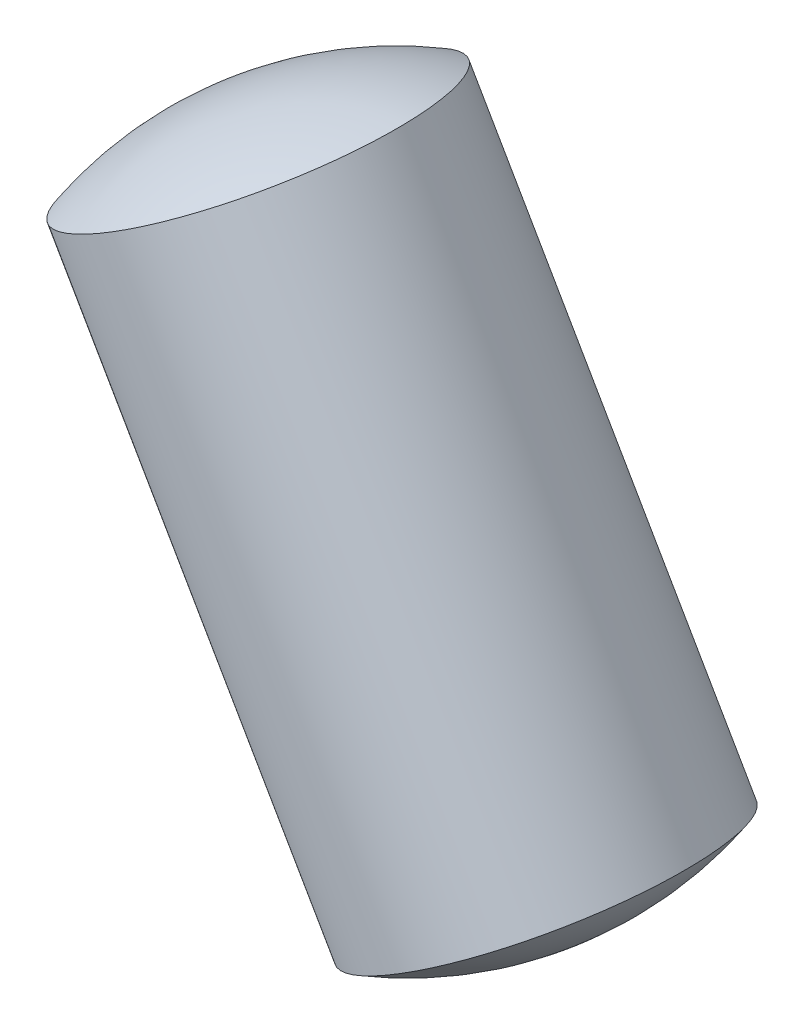
ISO-10303-21;
HEADER;
FILE_DESCRIPTION(('STEP AP214'),'2;1');
FILE_NAME('part.step','',(''),(''),'','','');
FILE_SCHEMA(('AUTOMOTIVE_DESIGN { 1 0 10303 214 1 1 1 1 }'));
ENDSEC;
DATA;
#1=APPLICATION_CONTEXT('core data for automotive mechanical design processes');
#2=APPLICATION_PROTOCOL_DEFINITION('international standard','automotive_design',2000,#1);
#3=PRODUCT_CONTEXT('',#1,'mechanical');
#4=PRODUCT('Part','Part','',(#3));
#5=PRODUCT_RELATED_PRODUCT_CATEGORY('part','',(#4));
#6=PRODUCT_DEFINITION_FORMATION('','',#4);
#7=PRODUCT_DEFINITION_CONTEXT('part definition',#1,'design');
#8=PRODUCT_DEFINITION('design','',#6,#7);
#9=PRODUCT_DEFINITION_SHAPE('','',#8);
#10=(LENGTH_UNIT() NAMED_UNIT(*) SI_UNIT(.MILLI.,.METRE.));
#11=(NAMED_UNIT(*) PLANE_ANGLE_UNIT() SI_UNIT($,.RADIAN.));
#12=(NAMED_UNIT(*) SI_UNIT($,.STERADIAN.) SOLID_ANGLE_UNIT());
#13=UNCERTAINTY_MEASURE_WITH_UNIT(LENGTH_MEASURE(1.E-05),#10,'distance_accuracy_value','');
#14=(GEOMETRIC_REPRESENTATION_CONTEXT(3) GLOBAL_UNCERTAINTY_ASSIGNED_CONTEXT((#13)) GLOBAL_UNIT_ASSIGNED_CONTEXT((#10,
#11,#12)) REPRESENTATION_CONTEXT('',''));
#15=CARTESIAN_POINT('',(0.,0.,0.));
#16=DIRECTION('',(0.,0.,1.));
#17=DIRECTION('',(1.,0.,0.));
#18=AXIS2_PLACEMENT_3D('',#15,#16,#17);
#19=CARTESIAN_POINT('',(13.8009618943234,-23.90396719429,0.9));
#20=DIRECTION('',(-0.866025403784439,-0.5,0.));
#21=DIRECTION('',(0.5,-0.866025403784439,0.));
#22=AXIS2_PLACEMENT_3D('',#19,#20,#21);
#23=SPHERICAL_SURFACE('',#22,3.);
#24=CARTESIAN_POINT('',(13.8009618943234,-23.90396719429,0.9));
#25=DIRECTION('',(-0.5,0.866025403784439,0.));
#26=DIRECTION('',(0.,0.,-1.));
#27=AXIS2_PLACEMENT_3D('',#24,#25,#26);
#28=SPHERICAL_SURFACE('',#27,3.);
#29=CARTESIAN_POINT('',(15.1,-26.15396719429,0.9));
#30=DIRECTION('',(-0.5,0.866025403784439,0.));
#31=DIRECTION('',(0.,0.,-1.));
#32=AXIS2_PLACEMENT_3D('',#29,#30,#31);
#33=CIRCLE('',#32,1.5);
#34=CARTESIAN_POINT('',(15.1,-26.15396719429,-0.6));
#35=VERTEX_POINT('',#34);
#36=EDGE_CURVE('E11',#35,#35,#33,.T.);
#37=ORIENTED_EDGE('',*,*,#36,.F.);
#38=EDGE_LOOP('',(#37));
#39=FACE_BOUND('',#38,.T.);
#40=ADVANCED_FACE('F17',(#39),#28,.T.);
#41=CARTESIAN_POINT('',(13.6990381056767,-23.7274300138542,0.9));
#42=DIRECTION('',(-0.866025403784439,-0.5,0.));
#43=DIRECTION('',(-0.5,0.866025403784439,0.));
#44=AXIS2_PLACEMENT_3D('',#41,#42,#43);
#45=SPHERICAL_SURFACE('',#44,3.);
#46=CARTESIAN_POINT('',(13.6990381056767,-23.7274300138542,0.9));
#47=DIRECTION('',(-0.5,0.866025403784439,0.));
#48=DIRECTION('',(0.,0.,-1.));
#49=AXIS2_PLACEMENT_3D('',#46,#47,#48);
#50=SPHERICAL_SURFACE('',#49,3.);
#51=CARTESIAN_POINT('',(12.4,-21.477430013854,0.9));
#52=DIRECTION('',(-0.5,0.866025403784439,0.));
#53=DIRECTION('',(0.,0.,-1.));
#54=AXIS2_PLACEMENT_3D('',#51,#52,#53);
#55=CIRCLE('',#54,1.5);
#56=CARTESIAN_POINT('',(12.4,-21.477430013854,-0.6));
#57=VERTEX_POINT('',#56);
#58=EDGE_CURVE('E26',#57,#57,#55,.T.);
#59=ORIENTED_EDGE('',*,*,#58,.T.);
#60=EDGE_LOOP('',(#59));
#61=FACE_BOUND('',#60,.T.);
#62=ADVANCED_FACE('F19',(#61),#50,.T.);
#63=CARTESIAN_POINT('',(13.075,-22.6465643089631,0.9));
#64=DIRECTION('',(-0.5,0.866025403784439,0.));
#65=DIRECTION('',(0.,0.,-1.));
#66=AXIS2_PLACEMENT_3D('',#63,#64,#65);
#67=CYLINDRICAL_SURFACE('',#66,1.5);
#68=ORIENTED_EDGE('',*,*,#36,.T.);
#69=EDGE_LOOP('',(#68));
#70=FACE_BOUND('',#69,.T.);
#71=ORIENTED_EDGE('',*,*,#58,.F.);
#72=EDGE_LOOP('',(#71));
#73=FACE_BOUND('',#72,.T.);
#74=ADVANCED_FACE('F47',(#70,#73),#67,.T.);
#75=CLOSED_SHELL('',(#40,#62,#74));
#76=MANIFOLD_SOLID_BREP('B1',#75);
#77=ADVANCED_BREP_SHAPE_REPRESENTATION('',(#18,#76),#14);
#78=SHAPE_DEFINITION_REPRESENTATION(#9,#77);
ENDSEC;
END-ISO-10303-21;
